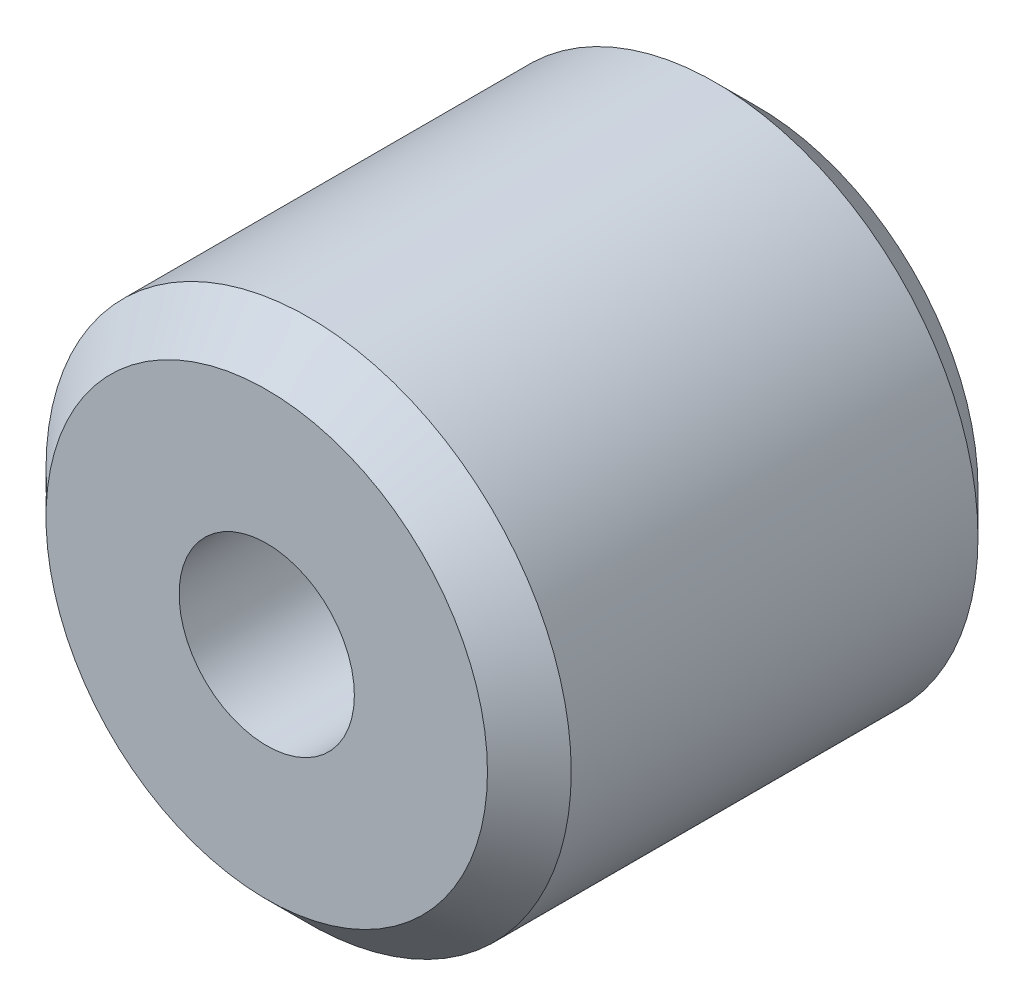
ISO-10303-21;
HEADER;
FILE_DESCRIPTION(('STEP AP214'),'2;1');
FILE_NAME('part.step','',(''),(''),'','','');
FILE_SCHEMA(('AUTOMOTIVE_DESIGN { 1 0 10303 214 1 1 1 1 }'));
ENDSEC;
DATA;
#1=APPLICATION_CONTEXT('core data for automotive mechanical design processes');
#2=APPLICATION_PROTOCOL_DEFINITION('international standard','automotive_design',2000,#1);
#3=PRODUCT_CONTEXT('',#1,'mechanical');
#4=PRODUCT('Part','Part','',(#3));
#5=PRODUCT_RELATED_PRODUCT_CATEGORY('part','',(#4));
#6=PRODUCT_DEFINITION_FORMATION('','',#4);
#7=PRODUCT_DEFINITION_CONTEXT('part definition',#1,'design');
#8=PRODUCT_DEFINITION('design','',#6,#7);
#9=PRODUCT_DEFINITION_SHAPE('','',#8);
#10=(LENGTH_UNIT() NAMED_UNIT(*) SI_UNIT(.MILLI.,.METRE.));
#11=(NAMED_UNIT(*) PLANE_ANGLE_UNIT() SI_UNIT($,.RADIAN.));
#12=(NAMED_UNIT(*) SI_UNIT($,.STERADIAN.) SOLID_ANGLE_UNIT());
#13=UNCERTAINTY_MEASURE_WITH_UNIT(LENGTH_MEASURE(1.E-05),#10,'distance_accuracy_value','');
#14=(GEOMETRIC_REPRESENTATION_CONTEXT(3) GLOBAL_UNCERTAINTY_ASSIGNED_CONTEXT((#13)) GLOBAL_UNIT_ASSIGNED_CONTEXT((#10,
#11,#12)) REPRESENTATION_CONTEXT('',''));
#15=CARTESIAN_POINT('',(0.,0.,0.));
#16=DIRECTION('',(0.,0.,1.));
#17=DIRECTION('',(1.,0.,0.));
#18=AXIS2_PLACEMENT_3D('',#15,#16,#17);
#19=CARTESIAN_POINT('',(0.,0.,4.45));
#20=DIRECTION('',(0.,0.,1.));
#21=DIRECTION('',(1.,0.,0.));
#22=AXIS2_PLACEMENT_3D('',#19,#20,#21);
#23=PLANE('',#22);
#24=CARTESIAN_POINT('',(0.,0.,4.45));
#25=DIRECTION('',(0.,0.,1.));
#26=DIRECTION('',(1.,0.,0.));
#27=AXIS2_PLACEMENT_3D('',#24,#25,#26);
#28=CIRCLE('',#27,4.005);
#29=CARTESIAN_POINT('',(4.005,0.,4.45));
#30=VERTEX_POINT('',#29);
#31=EDGE_CURVE('E10',#30,#30,#28,.T.);
#32=ORIENTED_EDGE('',*,*,#31,.T.);
#33=EDGE_LOOP('',(#32));
#34=FACE_BOUND('',#33,.T.);
#35=CARTESIAN_POINT('',(0.,0.,4.45));
#36=DIRECTION('',(0.,0.,1.));
#37=DIRECTION('',(1.,0.,0.));
#38=AXIS2_PLACEMENT_3D('',#35,#36,#37);
#39=CIRCLE('',#38,1.59);
#40=CARTESIAN_POINT('',(1.59,0.,4.45));
#41=VERTEX_POINT('',#40);
#42=EDGE_CURVE('E70',#41,#41,#39,.T.);
#43=ORIENTED_EDGE('',*,*,#42,.F.);
#44=EDGE_LOOP('',(#43));
#45=FACE_BOUND('',#44,.T.);
#46=ADVANCED_FACE('F45',(#34,#45),#23,.T.);
#47=CARTESIAN_POINT('',(0.,0.,-4.45));
#48=DIRECTION('',(0.,0.,1.));
#49=DIRECTION('',(1.,0.,0.));
#50=AXIS2_PLACEMENT_3D('',#47,#48,#49);
#51=PLANE('',#50);
#52=CARTESIAN_POINT('',(0.,0.,-4.45));
#53=DIRECTION('',(0.,0.,1.));
#54=DIRECTION('',(1.,0.,0.));
#55=AXIS2_PLACEMENT_3D('',#52,#53,#54);
#56=CIRCLE('',#55,4.00499999999999);
#57=CARTESIAN_POINT('',(4.00499999999999,0.,-4.45));
#58=VERTEX_POINT('',#57);
#59=EDGE_CURVE('E54',#58,#58,#56,.F.);
#60=ORIENTED_EDGE('',*,*,#59,.T.);
#61=EDGE_LOOP('',(#60));
#62=FACE_BOUND('',#61,.T.);
#63=CARTESIAN_POINT('',(0.,0.,-4.45));
#64=DIRECTION('',(0.,0.,1.));
#65=DIRECTION('',(1.,0.,0.));
#66=AXIS2_PLACEMENT_3D('',#63,#64,#65);
#67=CIRCLE('',#66,1.59);
#68=CARTESIAN_POINT('',(1.59,0.,-4.45));
#69=VERTEX_POINT('',#68);
#70=EDGE_CURVE('E71',#69,#69,#67,.T.);
#71=ORIENTED_EDGE('',*,*,#70,.T.);
#72=EDGE_LOOP('',(#71));
#73=FACE_BOUND('',#72,.T.);
#74=ADVANCED_FACE('F83',(#62,#73),#51,.F.);
#75=CARTESIAN_POINT('',(0.,0.,4.45));
#76=DIRECTION('',(0.,0.,-1.));
#77=DIRECTION('',(-1.,0.,0.));
#78=AXIS2_PLACEMENT_3D('',#75,#76,#77);
#79=CYLINDRICAL_SURFACE('',#78,4.765);
#80=CARTESIAN_POINT('',(0.,0.,-3.69));
#81=DIRECTION('',(0.,0.,1.));
#82=DIRECTION('',(1.,0.,0.));
#83=AXIS2_PLACEMENT_3D('',#80,#81,#82);
#84=CIRCLE('',#83,4.765);
#85=CARTESIAN_POINT('',(4.765,0.,-3.69));
#86=VERTEX_POINT('',#85);
#87=EDGE_CURVE('E59',#86,#86,#84,.T.);
#88=ORIENTED_EDGE('',*,*,#87,.T.);
#89=EDGE_LOOP('',(#88));
#90=FACE_BOUND('',#89,.T.);
#91=CARTESIAN_POINT('',(0.,0.,3.69));
#92=DIRECTION('',(0.,0.,1.));
#93=DIRECTION('',(1.,0.,0.));
#94=AXIS2_PLACEMENT_3D('',#91,#92,#93);
#95=CIRCLE('',#94,4.765);
#96=CARTESIAN_POINT('',(4.765,0.,3.69));
#97=VERTEX_POINT('',#96);
#98=EDGE_CURVE('E64',#97,#97,#95,.F.);
#99=ORIENTED_EDGE('',*,*,#98,.T.);
#100=EDGE_LOOP('',(#99));
#101=FACE_BOUND('',#100,.T.);
#102=ADVANCED_FACE('F88',(#90,#101),#79,.T.);
#103=CARTESIAN_POINT('',(0.,0.,4.45));
#104=DIRECTION('',(0.,0.,-1.));
#105=DIRECTION('',(-1.,0.,0.));
#106=AXIS2_PLACEMENT_3D('',#103,#104,#105);
#107=CYLINDRICAL_SURFACE('',#106,1.59);
#108=ORIENTED_EDGE('',*,*,#42,.T.);
#109=EDGE_LOOP('',(#108));
#110=FACE_BOUND('',#109,.T.);
#111=ORIENTED_EDGE('',*,*,#70,.F.);
#112=EDGE_LOOP('',(#111));
#113=FACE_BOUND('',#112,.T.);
#114=ADVANCED_FACE('F79',(#110,#113),#107,.F.);
#115=CARTESIAN_POINT('',(0.,0.,-3.69));
#116=DIRECTION('',(0.,0.,1.));
#117=DIRECTION('',(1.,0.,0.));
#118=AXIS2_PLACEMENT_3D('',#115,#116,#117);
#119=CONICAL_SURFACE('',#118,4.765,0.78539816339745);
#120=ORIENTED_EDGE('',*,*,#59,.F.);
#121=EDGE_LOOP('',(#120));
#122=FACE_BOUND('',#121,.T.);
#123=ORIENTED_EDGE('',*,*,#87,.F.);
#124=EDGE_LOOP('',(#123));
#125=FACE_BOUND('',#124,.T.);
#126=ADVANCED_FACE('F95',(#122,#125),#119,.T.);
#127=CARTESIAN_POINT('',(0.,0.,4.45));
#128=DIRECTION('',(0.,0.,-1.));
#129=DIRECTION('',(-1.,0.,0.));
#130=AXIS2_PLACEMENT_3D('',#127,#128,#129);
#131=CONICAL_SURFACE('',#130,4.005,0.785398163397447);
#132=ORIENTED_EDGE('',*,*,#98,.F.);
#133=EDGE_LOOP('',(#132));
#134=FACE_BOUND('',#133,.T.);
#135=ORIENTED_EDGE('',*,*,#31,.F.);
#136=EDGE_LOOP('',(#135));
#137=FACE_BOUND('',#136,.T.);
#138=ADVANCED_FACE('F48',(#134,#137),#131,.T.);
#139=CLOSED_SHELL('',(#46,#74,#102,#114,#126,#138));
#140=MANIFOLD_SOLID_BREP('B2',#139);
#141=ADVANCED_BREP_SHAPE_REPRESENTATION('',(#18,#140),#14);
#142=SHAPE_DEFINITION_REPRESENTATION(#9,#141);
ENDSEC;
END-ISO-10303-21;
